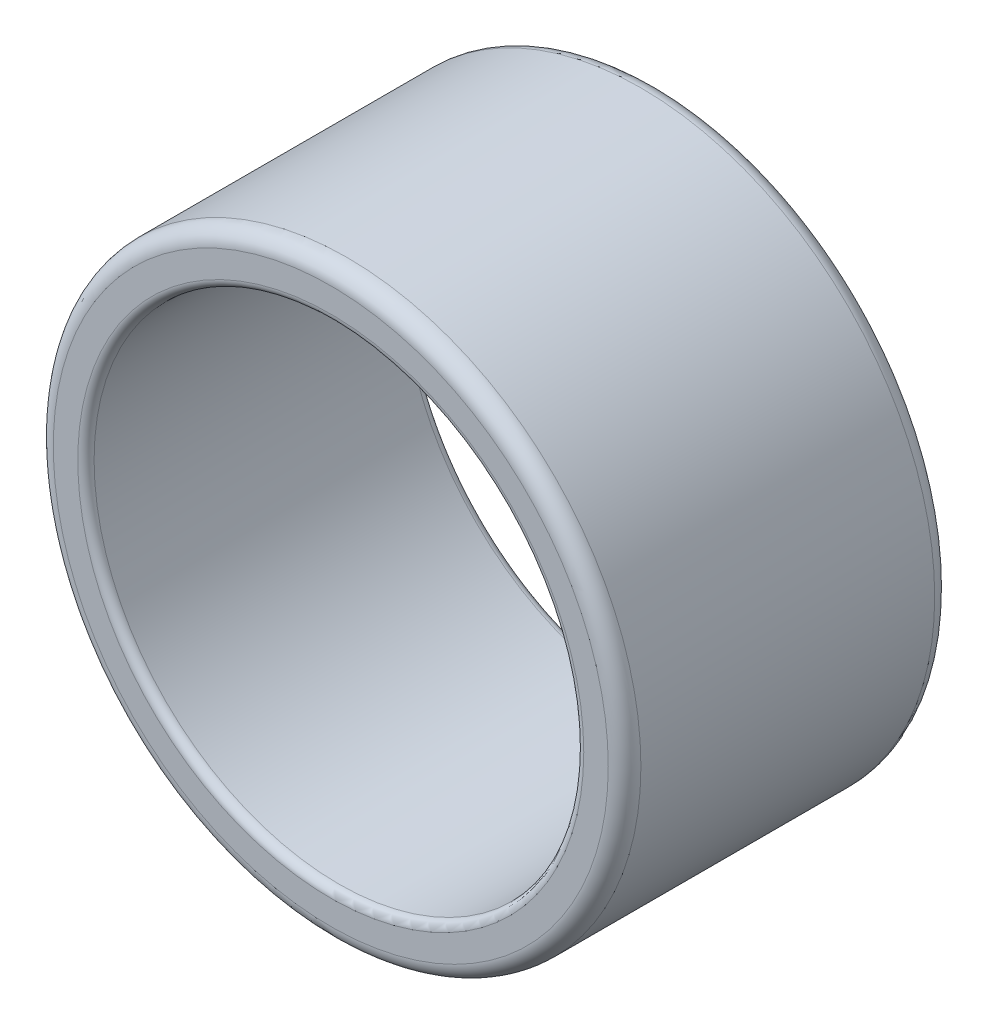
ISO-10303-21;
HEADER;
FILE_DESCRIPTION(('STEP AP214'),'2;1');
FILE_NAME('part.step','',(''),(''),'','','');
FILE_SCHEMA(('AUTOMOTIVE_DESIGN { 1 0 10303 214 1 1 1 1 }'));
ENDSEC;
DATA;
#1=APPLICATION_CONTEXT('core data for automotive mechanical design processes');
#2=APPLICATION_PROTOCOL_DEFINITION('international standard','automotive_design',2000,#1);
#3=PRODUCT_CONTEXT('',#1,'mechanical');
#4=PRODUCT('Part','Part','',(#3));
#5=PRODUCT_RELATED_PRODUCT_CATEGORY('part','',(#4));
#6=PRODUCT_DEFINITION_FORMATION('','',#4);
#7=PRODUCT_DEFINITION_CONTEXT('part definition',#1,'design');
#8=PRODUCT_DEFINITION('design','',#6,#7);
#9=PRODUCT_DEFINITION_SHAPE('','',#8);
#10=(LENGTH_UNIT() NAMED_UNIT(*) SI_UNIT(.MILLI.,.METRE.));
#11=(NAMED_UNIT(*) PLANE_ANGLE_UNIT() SI_UNIT($,.RADIAN.));
#12=(NAMED_UNIT(*) SI_UNIT($,.STERADIAN.) SOLID_ANGLE_UNIT());
#13=UNCERTAINTY_MEASURE_WITH_UNIT(LENGTH_MEASURE(1.E-05),#10,'distance_accuracy_value','');
#14=(GEOMETRIC_REPRESENTATION_CONTEXT(3) GLOBAL_UNCERTAINTY_ASSIGNED_CONTEXT((#13)) GLOBAL_UNIT_ASSIGNED_CONTEXT((#10,
#11,#12)) REPRESENTATION_CONTEXT('',''));
#15=CARTESIAN_POINT('',(0.,0.,0.));
#16=DIRECTION('',(0.,0.,1.));
#17=DIRECTION('',(1.,0.,0.));
#18=AXIS2_PLACEMENT_3D('',#15,#16,#17);
#19=CARTESIAN_POINT('',(0.,0.,200.));
#20=DIRECTION('',(0.,0.,-1.));
#21=DIRECTION('',(-1.,0.,0.));
#22=AXIS2_PLACEMENT_3D('',#19,#20,#21);
#23=CYLINDRICAL_SURFACE('',#22,180.);
#24=CARTESIAN_POINT('',(0.,0.,10.));
#25=DIRECTION('',(0.,0.,1.));
#26=DIRECTION('',(1.,0.,0.));
#27=AXIS2_PLACEMENT_3D('',#24,#25,#26);
#28=CIRCLE('',#27,180.);
#29=CARTESIAN_POINT('',(180.,0.,10.));
#30=VERTEX_POINT('',#29);
#31=EDGE_CURVE('E56',#30,#30,#28,.T.);
#32=ORIENTED_EDGE('',*,*,#31,.T.);
#33=EDGE_LOOP('',(#32));
#34=FACE_BOUND('',#33,.T.);
#35=CARTESIAN_POINT('',(0.,0.,190.));
#36=DIRECTION('',(0.,0.,1.));
#37=DIRECTION('',(1.,0.,0.));
#38=AXIS2_PLACEMENT_3D('',#35,#36,#37);
#39=CIRCLE('',#38,180.);
#40=CARTESIAN_POINT('',(180.,0.,190.));
#41=VERTEX_POINT('',#40);
#42=EDGE_CURVE('E59',#41,#41,#39,.F.);
#43=ORIENTED_EDGE('',*,*,#42,.T.);
#44=EDGE_LOOP('',(#43));
#45=FACE_BOUND('',#44,.T.);
#46=ADVANCED_FACE('F30',(#34,#45),#23,.T.);
#47=CARTESIAN_POINT('',(0.,0.,200.));
#48=DIRECTION('',(0.,0.,1.));
#49=DIRECTION('',(1.,0.,0.));
#50=AXIS2_PLACEMENT_3D('',#47,#48,#49);
#51=PLANE('',#50);
#52=CARTESIAN_POINT('',(0.,0.,200.));
#53=DIRECTION('',(0.,0.,1.));
#54=DIRECTION('',(1.,0.,0.));
#55=AXIS2_PLACEMENT_3D('',#52,#53,#54);
#56=CIRCLE('',#55,155.);
#57=CARTESIAN_POINT('',(155.,0.,200.));
#58=VERTEX_POINT('',#57);
#59=EDGE_CURVE('E45',#58,#58,#56,.F.);
#60=ORIENTED_EDGE('',*,*,#59,.T.);
#61=EDGE_LOOP('',(#60));
#62=FACE_BOUND('',#61,.T.);
#63=CARTESIAN_POINT('',(0.,0.,200.));
#64=DIRECTION('',(0.,0.,1.));
#65=DIRECTION('',(1.,0.,0.));
#66=AXIS2_PLACEMENT_3D('',#63,#64,#65);
#67=CIRCLE('',#66,170.);
#68=CARTESIAN_POINT('',(170.,0.,200.));
#69=VERTEX_POINT('',#68);
#70=EDGE_CURVE('E50',#69,#69,#67,.T.);
#71=ORIENTED_EDGE('',*,*,#70,.T.);
#72=EDGE_LOOP('',(#71));
#73=FACE_BOUND('',#72,.T.);
#74=ADVANCED_FACE('F72',(#62,#73),#51,.T.);
#75=CARTESIAN_POINT('',(0.,0.,0.));
#76=DIRECTION('',(0.,0.,1.));
#77=DIRECTION('',(1.,0.,0.));
#78=AXIS2_PLACEMENT_3D('',#75,#76,#77);
#79=PLANE('',#78);
#80=CARTESIAN_POINT('',(0.,0.,0.));
#81=DIRECTION('',(0.,0.,1.));
#82=DIRECTION('',(1.,0.,0.));
#83=AXIS2_PLACEMENT_3D('',#80,#81,#82);
#84=CIRCLE('',#83,155.);
#85=CARTESIAN_POINT('',(155.,0.,0.));
#86=VERTEX_POINT('',#85);
#87=EDGE_CURVE('E10',#86,#86,#84,.T.);
#88=ORIENTED_EDGE('',*,*,#87,.T.);
#89=EDGE_LOOP('',(#88));
#90=FACE_BOUND('',#89,.T.);
#91=CARTESIAN_POINT('',(0.,0.,0.));
#92=DIRECTION('',(0.,0.,1.));
#93=DIRECTION('',(1.,0.,0.));
#94=AXIS2_PLACEMENT_3D('',#91,#92,#93);
#95=CIRCLE('',#94,170.);
#96=CARTESIAN_POINT('',(170.,0.,0.));
#97=VERTEX_POINT('',#96);
#98=EDGE_CURVE('E53',#97,#97,#95,.F.);
#99=ORIENTED_EDGE('',*,*,#98,.T.);
#100=EDGE_LOOP('',(#99));
#101=FACE_BOUND('',#100,.T.);
#102=ADVANCED_FACE('F74',(#90,#101),#79,.F.);
#103=CARTESIAN_POINT('',(0.,0.,10.));
#104=DIRECTION('',(0.,0.,1.));
#105=DIRECTION('',(1.,0.,0.));
#106=AXIS2_PLACEMENT_3D('',#103,#104,#105);
#107=TOROIDAL_SURFACE('',#106,170.,10.);
#108=ORIENTED_EDGE('',*,*,#98,.F.);
#109=EDGE_LOOP('',(#108));
#110=FACE_BOUND('',#109,.T.);
#111=ORIENTED_EDGE('',*,*,#31,.F.);
#112=EDGE_LOOP('',(#111));
#113=FACE_BOUND('',#112,.T.);
#114=ADVANCED_FACE('F68',(#110,#113),#107,.T.);
#115=CARTESIAN_POINT('',(0.,0.,190.));
#116=DIRECTION('',(0.,0.,1.));
#117=DIRECTION('',(1.,0.,0.));
#118=AXIS2_PLACEMENT_3D('',#115,#116,#117);
#119=TOROIDAL_SURFACE('',#118,170.,10.);
#120=ORIENTED_EDGE('',*,*,#42,.F.);
#121=EDGE_LOOP('',(#120));
#122=FACE_BOUND('',#121,.T.);
#123=ORIENTED_EDGE('',*,*,#70,.F.);
#124=EDGE_LOOP('',(#123));
#125=FACE_BOUND('',#124,.T.);
#126=ADVANCED_FACE('F64',(#122,#125),#119,.T.);
#127=CARTESIAN_POINT('',(0.,0.,200.));
#128=DIRECTION('',(0.,0.,-1.));
#129=DIRECTION('',(-1.,0.,0.));
#130=AXIS2_PLACEMENT_3D('',#127,#128,#129);
#131=CYLINDRICAL_SURFACE('',#130,150.);
#132=CARTESIAN_POINT('',(0.,0.,195.));
#133=DIRECTION('',(0.,0.,1.));
#134=DIRECTION('',(1.,0.,0.));
#135=AXIS2_PLACEMENT_3D('',#132,#133,#134);
#136=CIRCLE('',#135,150.);
#137=CARTESIAN_POINT('',(150.,0.,195.));
#138=VERTEX_POINT('',#137);
#139=EDGE_CURVE('E37',#138,#138,#136,.T.);
#140=ORIENTED_EDGE('',*,*,#139,.T.);
#141=EDGE_LOOP('',(#140));
#142=FACE_BOUND('',#141,.T.);
#143=CARTESIAN_POINT('',(0.,0.,5.));
#144=DIRECTION('',(0.,0.,1.));
#145=DIRECTION('',(1.,0.,0.));
#146=AXIS2_PLACEMENT_3D('',#143,#144,#145);
#147=CIRCLE('',#146,150.);
#148=CARTESIAN_POINT('',(150.,0.,5.));
#149=VERTEX_POINT('',#148);
#150=EDGE_CURVE('E41',#149,#149,#147,.F.);
#151=ORIENTED_EDGE('',*,*,#150,.T.);
#152=EDGE_LOOP('',(#151));
#153=FACE_BOUND('',#152,.T.);
#154=ADVANCED_FACE('F67',(#142,#153),#131,.F.);
#155=CARTESIAN_POINT('',(0.,0.,195.));
#156=DIRECTION('',(0.,0.,1.));
#157=DIRECTION('',(1.,0.,0.));
#158=AXIS2_PLACEMENT_3D('',#155,#156,#157);
#159=TOROIDAL_SURFACE('',#158,155.,5.);
#160=ORIENTED_EDGE('',*,*,#139,.F.);
#161=EDGE_LOOP('',(#160));
#162=FACE_BOUND('',#161,.T.);
#163=ORIENTED_EDGE('',*,*,#59,.F.);
#164=EDGE_LOOP('',(#163));
#165=FACE_BOUND('',#164,.T.);
#166=ADVANCED_FACE('F88',(#162,#165),#159,.T.);
#167=CARTESIAN_POINT('',(0.,0.,5.));
#168=DIRECTION('',(0.,0.,1.));
#169=DIRECTION('',(1.,0.,0.));
#170=AXIS2_PLACEMENT_3D('',#167,#168,#169);
#171=TOROIDAL_SURFACE('',#170,155.,5.);
#172=ORIENTED_EDGE('',*,*,#87,.F.);
#173=EDGE_LOOP('',(#172));
#174=FACE_BOUND('',#173,.T.);
#175=ORIENTED_EDGE('',*,*,#150,.F.);
#176=EDGE_LOOP('',(#175));
#177=FACE_BOUND('',#176,.T.);
#178=ADVANCED_FACE('F32',(#174,#177),#171,.T.);
#179=CLOSED_SHELL('',(#46,#74,#102,#114,#126,#154,#166,#178));
#180=MANIFOLD_SOLID_BREP('B2',#179);
#181=ADVANCED_BREP_SHAPE_REPRESENTATION('',(#18,#180),#14);
#182=SHAPE_DEFINITION_REPRESENTATION(#9,#181);
ENDSEC;
END-ISO-10303-21;
